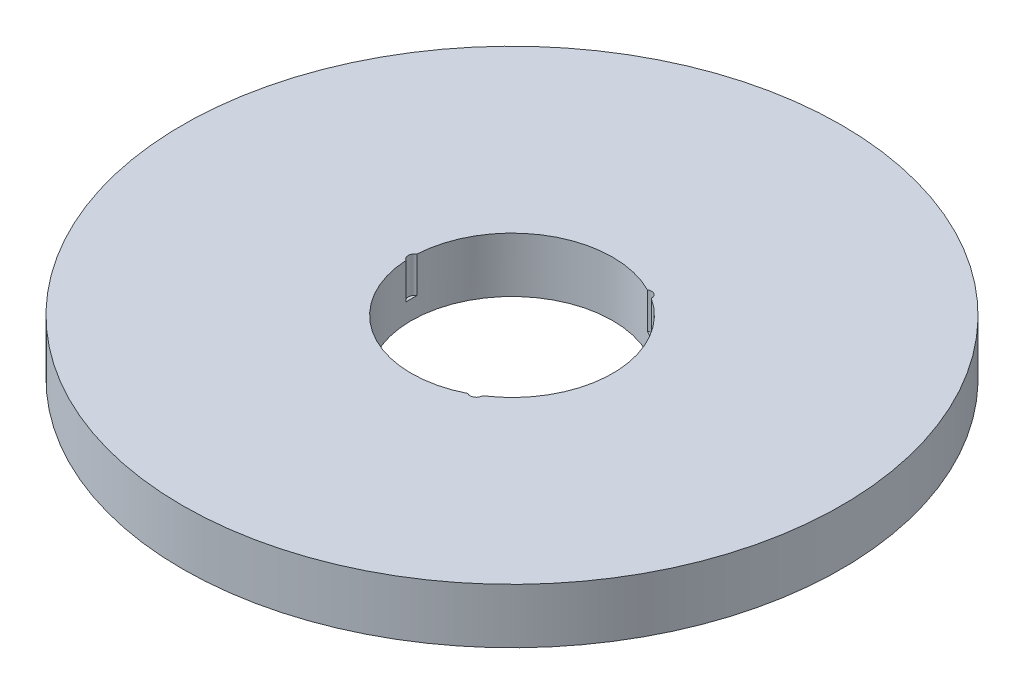
ISO-10303-21;
HEADER;
FILE_DESCRIPTION(('STEP AP214'),'2;1');
FILE_NAME('part.step','',(''),(''),'','','');
FILE_SCHEMA(('AUTOMOTIVE_DESIGN { 1 0 10303 214 1 1 1 1 }'));
ENDSEC;
DATA;
#1=APPLICATION_CONTEXT('core data for automotive mechanical design processes');
#2=APPLICATION_PROTOCOL_DEFINITION('international standard','automotive_design',2000,#1);
#3=PRODUCT_CONTEXT('',#1,'mechanical');
#4=PRODUCT('Part','Part','',(#3));
#5=PRODUCT_RELATED_PRODUCT_CATEGORY('part','',(#4));
#6=PRODUCT_DEFINITION_FORMATION('','',#4);
#7=PRODUCT_DEFINITION_CONTEXT('part definition',#1,'design');
#8=PRODUCT_DEFINITION('design','',#6,#7);
#9=PRODUCT_DEFINITION_SHAPE('','',#8);
#10=(LENGTH_UNIT() NAMED_UNIT(*) SI_UNIT(.MILLI.,.METRE.));
#11=(NAMED_UNIT(*) PLANE_ANGLE_UNIT() SI_UNIT($,.RADIAN.));
#12=(NAMED_UNIT(*) SI_UNIT($,.STERADIAN.) SOLID_ANGLE_UNIT());
#13=UNCERTAINTY_MEASURE_WITH_UNIT(LENGTH_MEASURE(1.E-05),#10,'distance_accuracy_value','');
#14=(GEOMETRIC_REPRESENTATION_CONTEXT(3) GLOBAL_UNCERTAINTY_ASSIGNED_CONTEXT((#13)) GLOBAL_UNIT_ASSIGNED_CONTEXT((#10,
#11,#12)) REPRESENTATION_CONTEXT('',''));
#15=CARTESIAN_POINT('',(0.,0.,0.));
#16=DIRECTION('',(0.,0.,1.));
#17=DIRECTION('',(1.,0.,0.));
#18=AXIS2_PLACEMENT_3D('',#15,#16,#17);
#19=CARTESIAN_POINT('',(0.,15.,0.));
#20=DIRECTION('',(0.,-1.,0.));
#21=DIRECTION('',(0.,0.,-1.));
#22=AXIS2_PLACEMENT_3D('',#19,#20,#21);
#23=CYLINDRICAL_SURFACE('',#22,90.);
#24=CARTESIAN_POINT('',(0.,15.,0.));
#25=DIRECTION('',(0.,1.,0.));
#26=DIRECTION('',(0.,0.,1.));
#27=AXIS2_PLACEMENT_3D('',#24,#25,#26);
#28=CIRCLE('',#27,90.);
#29=CARTESIAN_POINT('',(0.,15.,90.));
#30=VERTEX_POINT('',#29);
#31=EDGE_CURVE('E130',#30,#30,#28,.T.);
#32=ORIENTED_EDGE('',*,*,#31,.F.);
#33=EDGE_LOOP('',(#32));
#34=FACE_BOUND('',#33,.T.);
#35=CARTESIAN_POINT('',(0.,0.,0.));
#36=DIRECTION('',(0.,1.,0.));
#37=DIRECTION('',(0.,0.,1.));
#38=AXIS2_PLACEMENT_3D('',#35,#36,#37);
#39=CIRCLE('',#38,90.);
#40=CARTESIAN_POINT('',(0.,0.,90.));
#41=VERTEX_POINT('',#40);
#42=EDGE_CURVE('E117',#41,#41,#39,.T.);
#43=ORIENTED_EDGE('',*,*,#42,.T.);
#44=EDGE_LOOP('',(#43));
#45=FACE_BOUND('',#44,.T.);
#46=ADVANCED_FACE('F39',(#34,#45),#23,.T.);
#47=CARTESIAN_POINT('',(0.,15.,0.));
#48=DIRECTION('',(0.,1.,0.));
#49=DIRECTION('',(0.,0.,1.));
#50=AXIS2_PLACEMENT_3D('',#47,#48,#49);
#51=PLANE('',#50);
#52=CARTESIAN_POINT('',(13.3066939108115,15.,23.0478699342927));
#53=DIRECTION('',(0.,1.,0.));
#54=DIRECTION('',(0.866025403784436,0.,-0.500000000000004));
#55=AXIS2_PLACEMENT_3D('',#52,#53,#54);
#56=CIRCLE('',#55,1.7113821766642);
#57=CARTESIAN_POINT('',(12.4417007894595,15.,24.5245607802783));
#58=VERTEX_POINT('',#57);
#59=CARTESIAN_POINT('',(15.018042257647,15.,23.0371093400958));
#60=VERTEX_POINT('',#59);
#61=EDGE_CURVE('E148',#58,#60,#56,.T.);
#62=ORIENTED_EDGE('',*,*,#61,.F.);
#63=CARTESIAN_POINT('',(0.,15.,0.));
#64=DIRECTION('',(0.,1.,0.));
#65=DIRECTION('',(0.,0.,1.));
#66=AXIS2_PLACEMENT_3D('',#63,#64,#65);
#67=CIRCLE('',#66,27.5);
#68=CARTESIAN_POINT('',(-27.4597430471062,15.,1.48745144018244));
#69=VERTEX_POINT('',#68);
#70=EDGE_CURVE('E113',#69,#58,#67,.T.);
#71=ORIENTED_EDGE('',*,*,#70,.F.);
#72=CARTESIAN_POINT('',(-26.6133878216228,15.,0.));
#73=DIRECTION('',(0.,1.,0.));
#74=DIRECTION('',(0.,0.,1.));
#75=AXIS2_PLACEMENT_3D('',#72,#73,#74);
#76=CIRCLE('',#75,1.7113821766642);
#77=CARTESIAN_POINT('',(-27.4597430471062,15.,-1.48745144018244));
#78=VERTEX_POINT('',#77);
#79=EDGE_CURVE('E125',#78,#69,#76,.T.);
#80=ORIENTED_EDGE('',*,*,#79,.F.);
#81=CARTESIAN_POINT('',(12.4417007894591,15.,-24.5245607802784));
#82=VERTEX_POINT('',#81);
#83=EDGE_CURVE('E107',#82,#78,#67,.T.);
#84=ORIENTED_EDGE('',*,*,#83,.F.);
#85=CARTESIAN_POINT('',(13.3066939108112,15.,-23.0478699342929));
#86=DIRECTION('',(0.,1.,0.));
#87=DIRECTION('',(-0.866025403784443,0.,-0.499999999999992));
#88=AXIS2_PLACEMENT_3D('',#85,#86,#87);
#89=CIRCLE('',#88,1.7113821766642);
#90=CARTESIAN_POINT('',(15.0180422576467,15.,-23.037109340096));
#91=VERTEX_POINT('',#90);
#92=EDGE_CURVE('E95',#91,#82,#89,.T.);
#93=ORIENTED_EDGE('',*,*,#92,.F.);
#94=EDGE_CURVE('E106',#60,#91,#67,.T.);
#95=ORIENTED_EDGE('',*,*,#94,.F.);
#96=EDGE_LOOP('',(#62,#71,#80,#84,#93,#95));
#97=FACE_BOUND('',#96,.T.);
#98=ORIENTED_EDGE('',*,*,#31,.T.);
#99=EDGE_LOOP('',(#98));
#100=FACE_BOUND('',#99,.T.);
#101=ADVANCED_FACE('F102',(#97,#100),#51,.T.);
#102=CARTESIAN_POINT('',(0.,0.,0.));
#103=DIRECTION('',(0.,1.,0.));
#104=DIRECTION('',(0.,0.,1.));
#105=AXIS2_PLACEMENT_3D('',#102,#103,#104);
#106=PLANE('',#105);
#107=CARTESIAN_POINT('',(0.,0.,0.));
#108=DIRECTION('',(0.,1.,0.));
#109=DIRECTION('',(0.,0.,1.));
#110=AXIS2_PLACEMENT_3D('',#107,#108,#109);
#111=CIRCLE('',#110,27.5);
#112=CARTESIAN_POINT('',(0.,0.,27.5));
#113=VERTEX_POINT('',#112);
#114=EDGE_CURVE('E118',#113,#113,#111,.T.);
#115=ORIENTED_EDGE('',*,*,#114,.T.);
#116=EDGE_LOOP('',(#115));
#117=FACE_BOUND('',#116,.T.);
#118=ORIENTED_EDGE('',*,*,#42,.F.);
#119=EDGE_LOOP('',(#118));
#120=FACE_BOUND('',#119,.T.);
#121=ADVANCED_FACE('F161',(#117,#120),#106,.F.);
#122=CARTESIAN_POINT('',(0.,15.,0.));
#123=DIRECTION('',(0.,-1.,0.));
#124=DIRECTION('',(0.,0.,-1.));
#125=AXIS2_PLACEMENT_3D('',#122,#123,#124);
#126=CYLINDRICAL_SURFACE('',#125,27.5);
#127=DIRECTION('',(0.,1.,0.));
#128=VECTOR('',#127,1.);
#129=CARTESIAN_POINT('',(12.4417007894595,10.0857306201405,24.5245607802783));
#130=LINE('',#129,#128);
#131=CARTESIAN_POINT('',(12.4417007894595,5.1714612402811,24.5245607802783));
#132=VERTEX_POINT('',#131);
#133=EDGE_CURVE('E11',#132,#58,#130,.T.);
#134=ORIENTED_EDGE('',*,*,#133,.F.);
#135=CARTESIAN_POINT('',(0.,5.1714612402811,0.));
#136=DIRECTION('',(0.,1.,0.));
#137=DIRECTION('',(0.,0.,1.));
#138=AXIS2_PLACEMENT_3D('',#135,#136,#137);
#139=CIRCLE('',#138,27.5);
#140=CARTESIAN_POINT('',(15.018042257647,5.1714612402811,23.0371093400958));
#141=VERTEX_POINT('',#140);
#142=EDGE_CURVE('E100',#132,#141,#139,.T.);
#143=ORIENTED_EDGE('',*,*,#142,.T.);
#144=DIRECTION('',(0.,1.,0.));
#145=VECTOR('',#144,1.);
#146=CARTESIAN_POINT('',(15.018042257647,10.0857306201405,23.0371093400958));
#147=LINE('',#146,#145);
#148=EDGE_CURVE('E46',#60,#141,#147,.F.);
#149=ORIENTED_EDGE('',*,*,#148,.F.);
#150=ORIENTED_EDGE('',*,*,#94,.T.);
#151=DIRECTION('',(0.,1.,0.));
#152=VECTOR('',#151,1.);
#153=CARTESIAN_POINT('',(15.0180422576467,10.0857306201405,-23.037109340096));
#154=LINE('',#153,#152);
#155=CARTESIAN_POINT('',(15.0180422576467,5.1714612402811,-23.037109340096));
#156=VERTEX_POINT('',#155);
#157=EDGE_CURVE('E90',#156,#91,#154,.T.);
#158=ORIENTED_EDGE('',*,*,#157,.F.);
#159=CARTESIAN_POINT('',(0.,5.1714612402811,0.));
#160=DIRECTION('',(0.,1.,0.));
#161=DIRECTION('',(0.,0.,1.));
#162=AXIS2_PLACEMENT_3D('',#159,#160,#161);
#163=CIRCLE('',#162,27.5);
#164=CARTESIAN_POINT('',(12.4417007894591,5.1714612402811,-24.5245607802784));
#165=VERTEX_POINT('',#164);
#166=EDGE_CURVE('E143',#156,#165,#163,.T.);
#167=ORIENTED_EDGE('',*,*,#166,.T.);
#168=DIRECTION('',(0.,1.,0.));
#169=VECTOR('',#168,1.);
#170=CARTESIAN_POINT('',(12.4417007894591,10.0857306201405,-24.5245607802784));
#171=LINE('',#170,#169);
#172=EDGE_CURVE('E98',#82,#165,#171,.F.);
#173=ORIENTED_EDGE('',*,*,#172,.F.);
#174=ORIENTED_EDGE('',*,*,#83,.T.);
#175=DIRECTION('',(0.,1.,0.));
#176=VECTOR('',#175,1.);
#177=CARTESIAN_POINT('',(-27.4597430471062,10.0857306201405,-1.48745144018245));
#178=LINE('',#177,#176);
#179=CARTESIAN_POINT('',(-27.4597430471062,5.1714612402811,-1.48745144018244));
#180=VERTEX_POINT('',#179);
#181=EDGE_CURVE('E137',#180,#78,#178,.T.);
#182=ORIENTED_EDGE('',*,*,#181,.F.);
#183=CARTESIAN_POINT('',(0.,5.1714612402811,0.));
#184=DIRECTION('',(0.,1.,0.));
#185=DIRECTION('',(0.,0.,1.));
#186=AXIS2_PLACEMENT_3D('',#183,#184,#185);
#187=CIRCLE('',#186,27.5);
#188=CARTESIAN_POINT('',(-27.4597430471062,5.1714612402811,1.48745144018244));
#189=VERTEX_POINT('',#188);
#190=EDGE_CURVE('E128',#180,#189,#187,.T.);
#191=ORIENTED_EDGE('',*,*,#190,.T.);
#192=DIRECTION('',(0.,1.,0.));
#193=VECTOR('',#192,1.);
#194=CARTESIAN_POINT('',(-27.4597430471062,10.0857306201405,1.48745144018245));
#195=LINE('',#194,#193);
#196=EDGE_CURVE('E134',#69,#189,#195,.F.);
#197=ORIENTED_EDGE('',*,*,#196,.F.);
#198=ORIENTED_EDGE('',*,*,#70,.T.);
#199=EDGE_LOOP('',(#134,#143,#149,#150,#158,#167,#173,#174,#182,#191,#197,#198));
#200=FACE_BOUND('',#199,.T.);
#201=ORIENTED_EDGE('',*,*,#114,.F.);
#202=EDGE_LOOP('',(#201));
#203=FACE_BOUND('',#202,.T.);
#204=ADVANCED_FACE('F115',(#200,#203),#126,.F.);
#205=CARTESIAN_POINT('',(-26.6133878216228,5.1714612402811,0.));
#206=DIRECTION('',(0.,1.,0.));
#207=DIRECTION('',(0.,0.,1.));
#208=AXIS2_PLACEMENT_3D('',#205,#206,#207);
#209=CYLINDRICAL_SURFACE('',#208,1.7113821766642);
#210=ORIENTED_EDGE('',*,*,#181,.T.);
#211=ORIENTED_EDGE('',*,*,#79,.T.);
#212=ORIENTED_EDGE('',*,*,#196,.T.);
#213=CARTESIAN_POINT('',(-26.6133878216228,5.1714612402811,0.));
#214=DIRECTION('',(0.,1.,0.));
#215=DIRECTION('',(0.,0.,1.));
#216=AXIS2_PLACEMENT_3D('',#213,#214,#215);
#217=CIRCLE('',#216,1.7113821766642);
#218=EDGE_CURVE('E127',#180,#189,#217,.T.);
#219=ORIENTED_EDGE('',*,*,#218,.F.);
#220=EDGE_LOOP('',(#210,#211,#212,#219));
#221=FACE_BOUND('',#220,.T.);
#222=ADVANCED_FACE('F175',(#221),#209,.F.);
#223=CARTESIAN_POINT('',(-26.6133878216228,5.1714612402811,0.));
#224=DIRECTION('',(0.,1.,0.));
#225=DIRECTION('',(0.,0.,1.));
#226=AXIS2_PLACEMENT_3D('',#223,#224,#225);
#227=PLANE('',#226);
#228=ORIENTED_EDGE('',*,*,#218,.T.);
#229=ORIENTED_EDGE('',*,*,#190,.F.);
#230=EDGE_LOOP('',(#228,#229));
#231=FACE_BOUND('',#230,.T.);
#232=ADVANCED_FACE('F176',(#231),#227,.T.);
#233=CARTESIAN_POINT('',(13.3066939108112,5.1714612402811,-23.0478699342929));
#234=DIRECTION('',(0.,1.,0.));
#235=DIRECTION('',(0.,0.,1.));
#236=AXIS2_PLACEMENT_3D('',#233,#234,#235);
#237=CYLINDRICAL_SURFACE('',#236,1.7113821766642);
#238=ORIENTED_EDGE('',*,*,#157,.T.);
#239=ORIENTED_EDGE('',*,*,#92,.T.);
#240=ORIENTED_EDGE('',*,*,#172,.T.);
#241=CARTESIAN_POINT('',(13.3066939108112,5.1714612402811,-23.0478699342929));
#242=DIRECTION('',(0.,1.,0.));
#243=DIRECTION('',(-0.866025403784443,0.,-0.499999999999992));
#244=AXIS2_PLACEMENT_3D('',#241,#242,#243);
#245=CIRCLE('',#244,1.7113821766642);
#246=EDGE_CURVE('E56',#156,#165,#245,.T.);
#247=ORIENTED_EDGE('',*,*,#246,.F.);
#248=EDGE_LOOP('',(#238,#239,#240,#247));
#249=FACE_BOUND('',#248,.T.);
#250=ADVANCED_FACE('F93',(#249),#237,.F.);
#251=CARTESIAN_POINT('',(13.3066939108112,5.1714612402811,-23.0478699342929));
#252=DIRECTION('',(0.,1.,0.));
#253=DIRECTION('',(-0.866025403784443,0.,-0.499999999999992));
#254=AXIS2_PLACEMENT_3D('',#251,#252,#253);
#255=PLANE('',#254);
#256=ORIENTED_EDGE('',*,*,#246,.T.);
#257=ORIENTED_EDGE('',*,*,#166,.F.);
#258=EDGE_LOOP('',(#256,#257));
#259=FACE_BOUND('',#258,.T.);
#260=ADVANCED_FACE('F153',(#259),#255,.T.);
#261=CARTESIAN_POINT('',(13.3066939108115,5.1714612402811,23.0478699342927));
#262=DIRECTION('',(0.,1.,0.));
#263=DIRECTION('',(0.,0.,1.));
#264=AXIS2_PLACEMENT_3D('',#261,#262,#263);
#265=CYLINDRICAL_SURFACE('',#264,1.7113821766642);
#266=ORIENTED_EDGE('',*,*,#133,.T.);
#267=ORIENTED_EDGE('',*,*,#61,.T.);
#268=ORIENTED_EDGE('',*,*,#148,.T.);
#269=CARTESIAN_POINT('',(13.3066939108115,5.1714612402811,23.0478699342927));
#270=DIRECTION('',(0.,1.,0.));
#271=DIRECTION('',(0.866025403784436,0.,-0.500000000000004));
#272=AXIS2_PLACEMENT_3D('',#269,#270,#271);
#273=CIRCLE('',#272,1.7113821766642);
#274=EDGE_CURVE('E55',#132,#141,#273,.T.);
#275=ORIENTED_EDGE('',*,*,#274,.F.);
#276=EDGE_LOOP('',(#266,#267,#268,#275));
#277=FACE_BOUND('',#276,.T.);
#278=ADVANCED_FACE('F144',(#277),#265,.F.);
#279=CARTESIAN_POINT('',(13.3066939108115,5.1714612402811,23.0478699342927));
#280=DIRECTION('',(0.,1.,0.));
#281=DIRECTION('',(0.866025403784436,0.,-0.500000000000004));
#282=AXIS2_PLACEMENT_3D('',#279,#280,#281);
#283=PLANE('',#282);
#284=ORIENTED_EDGE('',*,*,#274,.T.);
#285=ORIENTED_EDGE('',*,*,#142,.F.);
#286=EDGE_LOOP('',(#284,#285));
#287=FACE_BOUND('',#286,.T.);
#288=ADVANCED_FACE('F150',(#287),#283,.T.);
#289=CLOSED_SHELL('',(#46,#101,#121,#204,#222,#232,#250,#260,#278,#288));
#290=MANIFOLD_SOLID_BREP('B2',#289);
#291=ADVANCED_BREP_SHAPE_REPRESENTATION('',(#18,#290),#14);
#292=SHAPE_DEFINITION_REPRESENTATION(#9,#291);
ENDSEC;
END-ISO-10303-21;
